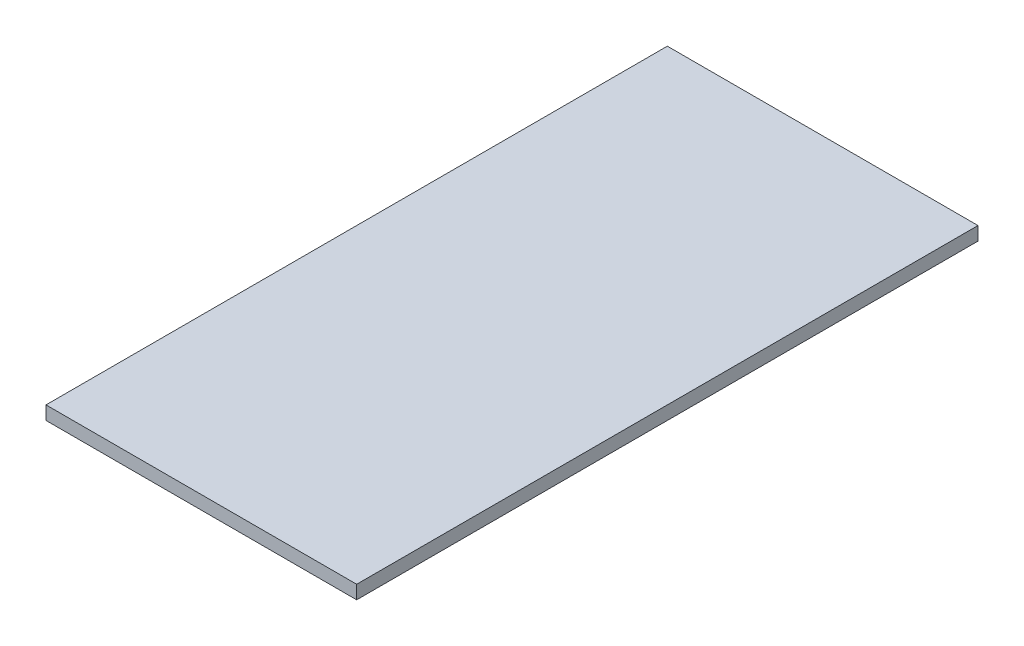
ISO-10303-21;
HEADER;
FILE_DESCRIPTION(('STEP AP214'),'2;1');
FILE_NAME('part.step','',(''),(''),'','','');
FILE_SCHEMA(('AUTOMOTIVE_DESIGN { 1 0 10303 214 1 1 1 1 }'));
ENDSEC;
DATA;
#1=APPLICATION_CONTEXT('core data for automotive mechanical design processes');
#2=APPLICATION_PROTOCOL_DEFINITION('international standard','automotive_design',2000,#1);
#3=PRODUCT_CONTEXT('',#1,'mechanical');
#4=PRODUCT('Part','Part','',(#3));
#5=PRODUCT_RELATED_PRODUCT_CATEGORY('part','',(#4));
#6=PRODUCT_DEFINITION_FORMATION('','',#4);
#7=PRODUCT_DEFINITION_CONTEXT('part definition',#1,'design');
#8=PRODUCT_DEFINITION('design','',#6,#7);
#9=PRODUCT_DEFINITION_SHAPE('','',#8);
#10=(LENGTH_UNIT() NAMED_UNIT(*) SI_UNIT(.MILLI.,.METRE.));
#11=(NAMED_UNIT(*) PLANE_ANGLE_UNIT() SI_UNIT($,.RADIAN.));
#12=(NAMED_UNIT(*) SI_UNIT($,.STERADIAN.) SOLID_ANGLE_UNIT());
#13=UNCERTAINTY_MEASURE_WITH_UNIT(LENGTH_MEASURE(1.E-05),#10,'distance_accuracy_value','');
#14=(GEOMETRIC_REPRESENTATION_CONTEXT(3) GLOBAL_UNCERTAINTY_ASSIGNED_CONTEXT((#13)) GLOBAL_UNIT_ASSIGNED_CONTEXT((#10,
#11,#12)) REPRESENTATION_CONTEXT('',''));
#15=CARTESIAN_POINT('',(0.,0.,0.));
#16=DIRECTION('',(0.,0.,1.));
#17=DIRECTION('',(1.,0.,0.));
#18=AXIS2_PLACEMENT_3D('',#15,#16,#17);
#19=CARTESIAN_POINT('',(-57.5,5.,-115.));
#20=DIRECTION('',(0.,0.,-1.));
#21=DIRECTION('',(-1.,0.,0.));
#22=AXIS2_PLACEMENT_3D('',#19,#20,#21);
#23=PLANE('',#22);
#24=DIRECTION('',(1.,0.,0.));
#25=VECTOR('',#24,1.);
#26=CARTESIAN_POINT('',(-57.5,0.,-115.));
#27=LINE('',#26,#25);
#28=CARTESIAN_POINT('',(-57.5,0.,-115.));
#29=VERTEX_POINT('',#28);
#30=CARTESIAN_POINT('',(57.5,0.,-115.));
#31=VERTEX_POINT('',#30);
#32=EDGE_CURVE('E101',#29,#31,#27,.T.);
#33=ORIENTED_EDGE('',*,*,#32,.F.);
#34=DIRECTION('',(0.,-1.,0.));
#35=VECTOR('',#34,1.);
#36=CARTESIAN_POINT('',(-57.5,5.,-115.));
#37=LINE('',#36,#35);
#38=CARTESIAN_POINT('',(-57.5,5.,-115.));
#39=VERTEX_POINT('',#38);
#40=EDGE_CURVE('E11',#39,#29,#37,.T.);
#41=ORIENTED_EDGE('',*,*,#40,.F.);
#42=DIRECTION('',(1.,0.,0.));
#43=VECTOR('',#42,1.);
#44=CARTESIAN_POINT('',(-57.5,5.,-115.));
#45=LINE('',#44,#43);
#46=CARTESIAN_POINT('',(57.5,5.,-115.));
#47=VERTEX_POINT('',#46);
#48=EDGE_CURVE('E96',#39,#47,#45,.T.);
#49=ORIENTED_EDGE('',*,*,#48,.T.);
#50=DIRECTION('',(0.,-1.,0.));
#51=VECTOR('',#50,1.);
#52=CARTESIAN_POINT('',(57.5,5.,-115.));
#53=LINE('',#52,#51);
#54=EDGE_CURVE('E39',#47,#31,#53,.T.);
#55=ORIENTED_EDGE('',*,*,#54,.T.);
#56=EDGE_LOOP('',(#33,#41,#49,#55));
#57=FACE_BOUND('',#56,.T.);
#58=ADVANCED_FACE('F36',(#57),#23,.T.);
#59=CARTESIAN_POINT('',(-57.5,5.,-115.));
#60=DIRECTION('',(1.,0.,0.));
#61=DIRECTION('',(0.,0.,-1.));
#62=AXIS2_PLACEMENT_3D('',#59,#60,#61);
#63=PLANE('',#62);
#64=DIRECTION('',(0.,0.,1.));
#65=VECTOR('',#64,1.);
#66=CARTESIAN_POINT('',(-57.5,0.,-115.));
#67=LINE('',#66,#65);
#68=CARTESIAN_POINT('',(-57.5,0.,115.));
#69=VERTEX_POINT('',#68);
#70=EDGE_CURVE('E69',#29,#69,#67,.T.);
#71=ORIENTED_EDGE('',*,*,#70,.T.);
#72=DIRECTION('',(0.,-1.,0.));
#73=VECTOR('',#72,1.);
#74=CARTESIAN_POINT('',(-57.5,5.,115.));
#75=LINE('',#74,#73);
#76=CARTESIAN_POINT('',(-57.5,5.,115.));
#77=VERTEX_POINT('',#76);
#78=EDGE_CURVE('E45',#77,#69,#75,.T.);
#79=ORIENTED_EDGE('',*,*,#78,.F.);
#80=DIRECTION('',(0.,0.,1.));
#81=VECTOR('',#80,1.);
#82=CARTESIAN_POINT('',(-57.5,5.,-115.));
#83=LINE('',#82,#81);
#84=EDGE_CURVE('E86',#39,#77,#83,.T.);
#85=ORIENTED_EDGE('',*,*,#84,.F.);
#86=ORIENTED_EDGE('',*,*,#40,.T.);
#87=EDGE_LOOP('',(#71,#79,#85,#86));
#88=FACE_BOUND('',#87,.T.);
#89=ADVANCED_FACE('F111',(#88),#63,.F.);
#90=CARTESIAN_POINT('',(-57.5,5.,115.));
#91=DIRECTION('',(0.,0.,-1.));
#92=DIRECTION('',(-1.,0.,0.));
#93=AXIS2_PLACEMENT_3D('',#90,#91,#92);
#94=PLANE('',#93);
#95=DIRECTION('',(1.,0.,0.));
#96=VECTOR('',#95,1.);
#97=CARTESIAN_POINT('',(-57.5,0.,115.));
#98=LINE('',#97,#96);
#99=CARTESIAN_POINT('',(57.5,0.,115.));
#100=VERTEX_POINT('',#99);
#101=EDGE_CURVE('E93',#69,#100,#98,.T.);
#102=ORIENTED_EDGE('',*,*,#101,.T.);
#103=DIRECTION('',(0.,-1.,0.));
#104=VECTOR('',#103,1.);
#105=CARTESIAN_POINT('',(57.5,5.,115.));
#106=LINE('',#105,#104);
#107=CARTESIAN_POINT('',(57.5,5.,115.));
#108=VERTEX_POINT('',#107);
#109=EDGE_CURVE('E90',#108,#100,#106,.T.);
#110=ORIENTED_EDGE('',*,*,#109,.F.);
#111=DIRECTION('',(1.,0.,0.));
#112=VECTOR('',#111,1.);
#113=CARTESIAN_POINT('',(-57.5,5.,115.));
#114=LINE('',#113,#112);
#115=EDGE_CURVE('E81',#77,#108,#114,.T.);
#116=ORIENTED_EDGE('',*,*,#115,.F.);
#117=ORIENTED_EDGE('',*,*,#78,.T.);
#118=EDGE_LOOP('',(#102,#110,#116,#117));
#119=FACE_BOUND('',#118,.T.);
#120=ADVANCED_FACE('F91',(#119),#94,.F.);
#121=CARTESIAN_POINT('',(57.5,5.,-115.));
#122=DIRECTION('',(1.,0.,0.));
#123=DIRECTION('',(0.,0.,-1.));
#124=AXIS2_PLACEMENT_3D('',#121,#122,#123);
#125=PLANE('',#124);
#126=DIRECTION('',(0.,0.,1.));
#127=VECTOR('',#126,1.);
#128=CARTESIAN_POINT('',(57.5,0.,-115.));
#129=LINE('',#128,#127);
#130=EDGE_CURVE('E104',#31,#100,#129,.T.);
#131=ORIENTED_EDGE('',*,*,#130,.F.);
#132=ORIENTED_EDGE('',*,*,#54,.F.);
#133=DIRECTION('',(0.,0.,1.));
#134=VECTOR('',#133,1.);
#135=CARTESIAN_POINT('',(57.5,5.,-115.));
#136=LINE('',#135,#134);
#137=EDGE_CURVE('E85',#47,#108,#136,.T.);
#138=ORIENTED_EDGE('',*,*,#137,.T.);
#139=ORIENTED_EDGE('',*,*,#109,.T.);
#140=EDGE_LOOP('',(#131,#132,#138,#139));
#141=FACE_BOUND('',#140,.T.);
#142=ADVANCED_FACE('F95',(#141),#125,.T.);
#143=CARTESIAN_POINT('',(0.,5.,0.));
#144=DIRECTION('',(0.,-1.,0.));
#145=DIRECTION('',(0.,0.,-1.));
#146=AXIS2_PLACEMENT_3D('',#143,#144,#145);
#147=PLANE('',#146);
#148=ORIENTED_EDGE('',*,*,#48,.F.);
#149=ORIENTED_EDGE('',*,*,#84,.T.);
#150=ORIENTED_EDGE('',*,*,#115,.T.);
#151=ORIENTED_EDGE('',*,*,#137,.F.);
#152=EDGE_LOOP('',(#148,#149,#150,#151));
#153=FACE_BOUND('',#152,.T.);
#154=ADVANCED_FACE('F84',(#153),#147,.F.);
#155=CARTESIAN_POINT('',(0.,0.,0.));
#156=DIRECTION('',(0.,-1.,0.));
#157=DIRECTION('',(0.,0.,-1.));
#158=AXIS2_PLACEMENT_3D('',#155,#156,#157);
#159=PLANE('',#158);
#160=ORIENTED_EDGE('',*,*,#32,.T.);
#161=ORIENTED_EDGE('',*,*,#130,.T.);
#162=ORIENTED_EDGE('',*,*,#101,.F.);
#163=ORIENTED_EDGE('',*,*,#70,.F.);
#164=EDGE_LOOP('',(#160,#161,#162,#163));
#165=FACE_BOUND('',#164,.T.);
#166=ADVANCED_FACE('F109',(#165),#159,.T.);
#167=CLOSED_SHELL('',(#58,#89,#120,#142,#154,#166));
#168=MANIFOLD_SOLID_BREP('B2',#167);
#169=ADVANCED_BREP_SHAPE_REPRESENTATION('',(#18,#168),#14);
#170=SHAPE_DEFINITION_REPRESENTATION(#9,#169);
ENDSEC;
END-ISO-10303-21;
